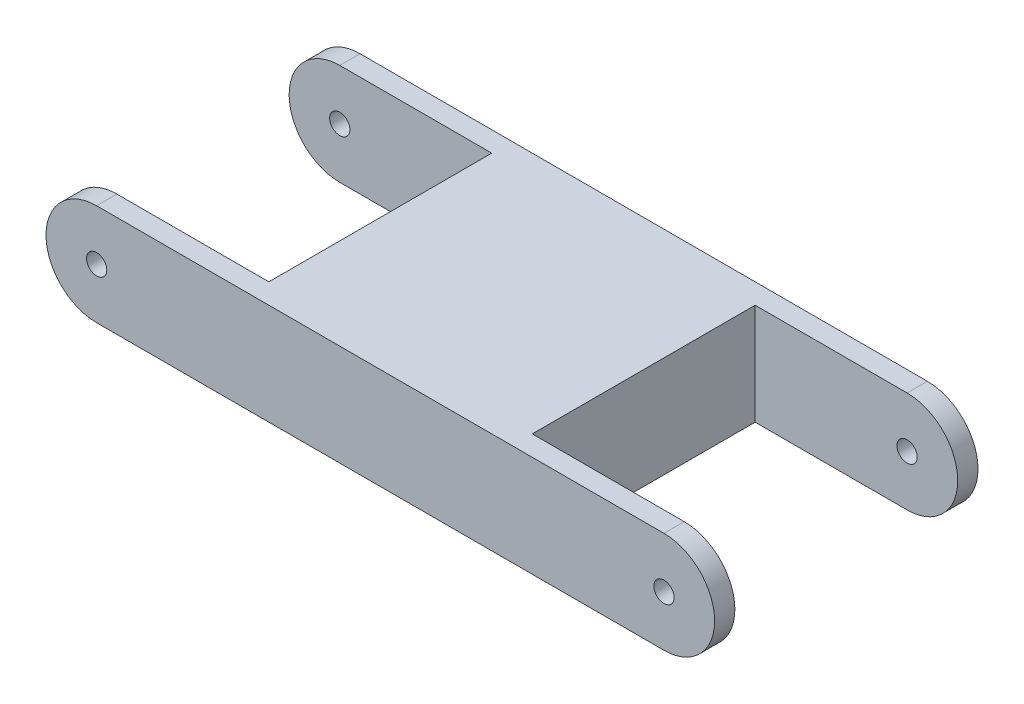
ISO-10303-21;
HEADER;
FILE_DESCRIPTION(('STEP AP214'),'2;1');
FILE_NAME('part.step','',(''),(''),'','','');
FILE_SCHEMA(('AUTOMOTIVE_DESIGN { 1 0 10303 214 1 1 1 1 }'));
ENDSEC;
DATA;
#1=APPLICATION_CONTEXT('core data for automotive mechanical design processes');
#2=APPLICATION_PROTOCOL_DEFINITION('international standard','automotive_design',2000,#1);
#3=PRODUCT_CONTEXT('',#1,'mechanical');
#4=PRODUCT('Part','Part','',(#3));
#5=PRODUCT_RELATED_PRODUCT_CATEGORY('part','',(#4));
#6=PRODUCT_DEFINITION_FORMATION('','',#4);
#7=PRODUCT_DEFINITION_CONTEXT('part definition',#1,'design');
#8=PRODUCT_DEFINITION('design','',#6,#7);
#9=PRODUCT_DEFINITION_SHAPE('','',#8);
#10=(LENGTH_UNIT() NAMED_UNIT(*) SI_UNIT(.MILLI.,.METRE.));
#11=(NAMED_UNIT(*) PLANE_ANGLE_UNIT() SI_UNIT($,.RADIAN.));
#12=(NAMED_UNIT(*) SI_UNIT($,.STERADIAN.) SOLID_ANGLE_UNIT());
#13=UNCERTAINTY_MEASURE_WITH_UNIT(LENGTH_MEASURE(1.E-05),#10,'distance_accuracy_value','');
#14=(GEOMETRIC_REPRESENTATION_CONTEXT(3) GLOBAL_UNCERTAINTY_ASSIGNED_CONTEXT((#13)) GLOBAL_UNIT_ASSIGNED_CONTEXT((#10,
#11,#12)) REPRESENTATION_CONTEXT('',''));
#15=CARTESIAN_POINT('',(0.,0.,0.));
#16=DIRECTION('',(0.,0.,1.));
#17=DIRECTION('',(1.,0.,0.));
#18=AXIS2_PLACEMENT_3D('',#15,#16,#17);
#19=CARTESIAN_POINT('',(-28.,-5.,26.));
#20=DIRECTION('',(0.,1.,0.));
#21=DIRECTION('',(0.,0.,1.));
#22=AXIS2_PLACEMENT_3D('',#19,#20,#21);
#23=PLANE('',#22);
#24=DIRECTION('',(1.,0.,0.));
#25=VECTOR('',#24,1.);
#26=CARTESIAN_POINT('',(-28.,-5.,2.00000000000001));
#27=LINE('',#26,#25);
#28=CARTESIAN_POINT('',(13.,-5.,2.));
#29=VERTEX_POINT('',#28);
#30=CARTESIAN_POINT('',(28.,-5.,1.99999999999999));
#31=VERTEX_POINT('',#30);
#32=EDGE_CURVE('E154',#29,#31,#27,.T.);
#33=ORIENTED_EDGE('',*,*,#32,.F.);
#34=DIRECTION('',(0.,0.,-1.));
#35=VECTOR('',#34,1.);
#36=CARTESIAN_POINT('',(13.,-5.,26.));
#37=LINE('',#36,#35);
#38=CARTESIAN_POINT('',(13.,-5.,24.));
#39=VERTEX_POINT('',#38);
#40=EDGE_CURVE('E156',#39,#29,#37,.T.);
#41=ORIENTED_EDGE('',*,*,#40,.F.);
#42=DIRECTION('',(-1.,0.,0.));
#43=VECTOR('',#42,1.);
#44=CARTESIAN_POINT('',(-28.,-5.,24.));
#45=LINE('',#44,#43);
#46=CARTESIAN_POINT('',(28.,-5.,24.));
#47=VERTEX_POINT('',#46);
#48=EDGE_CURVE('E138',#47,#39,#45,.T.);
#49=ORIENTED_EDGE('',*,*,#48,.F.);
#50=DIRECTION('',(0.,0.,-1.));
#51=VECTOR('',#50,1.);
#52=CARTESIAN_POINT('',(28.,-5.,26.));
#53=LINE('',#52,#51);
#54=CARTESIAN_POINT('',(28.,-5.,26.));
#55=VERTEX_POINT('',#54);
#56=EDGE_CURVE('E214',#55,#47,#53,.T.);
#57=ORIENTED_EDGE('',*,*,#56,.F.);
#58=DIRECTION('',(1.,0.,0.));
#59=VECTOR('',#58,1.);
#60=CARTESIAN_POINT('',(-28.,-5.,26.));
#61=LINE('',#60,#59);
#62=CARTESIAN_POINT('',(-28.,-5.,26.));
#63=VERTEX_POINT('',#62);
#64=EDGE_CURVE('E189',#63,#55,#61,.T.);
#65=ORIENTED_EDGE('',*,*,#64,.F.);
#66=DIRECTION('',(0.,0.,-1.));
#67=VECTOR('',#66,1.);
#68=CARTESIAN_POINT('',(-28.,-5.,26.));
#69=LINE('',#68,#67);
#70=CARTESIAN_POINT('',(-28.,-5.,24.));
#71=VERTEX_POINT('',#70);
#72=EDGE_CURVE('E217',#63,#71,#69,.T.);
#73=ORIENTED_EDGE('',*,*,#72,.T.);
#74=DIRECTION('',(-1.,0.,0.));
#75=VECTOR('',#74,1.);
#76=CARTESIAN_POINT('',(-28.,-5.,24.));
#77=LINE('',#76,#75);
#78=CARTESIAN_POINT('',(-13.,-5.,24.));
#79=VERTEX_POINT('',#78);
#80=EDGE_CURVE('E174',#79,#71,#77,.T.);
#81=ORIENTED_EDGE('',*,*,#80,.F.);
#82=DIRECTION('',(0.,0.,1.));
#83=VECTOR('',#82,1.);
#84=CARTESIAN_POINT('',(-13.,-5.,26.));
#85=LINE('',#84,#83);
#86=CARTESIAN_POINT('',(-13.,-5.,2.));
#87=VERTEX_POINT('',#86);
#88=EDGE_CURVE('E176',#87,#79,#85,.T.);
#89=ORIENTED_EDGE('',*,*,#88,.F.);
#90=DIRECTION('',(1.,0.,0.));
#91=VECTOR('',#90,1.);
#92=CARTESIAN_POINT('',(-28.,-5.,2.));
#93=LINE('',#92,#91);
#94=CARTESIAN_POINT('',(-28.,-5.,2.));
#95=VERTEX_POINT('',#94);
#96=EDGE_CURVE('E167',#95,#87,#93,.T.);
#97=ORIENTED_EDGE('',*,*,#96,.F.);
#98=CARTESIAN_POINT('',(-28.,-5.,0.));
#99=VERTEX_POINT('',#98);
#100=EDGE_CURVE('E216',#95,#99,#69,.T.);
#101=ORIENTED_EDGE('',*,*,#100,.T.);
#102=DIRECTION('',(1.,0.,0.));
#103=VECTOR('',#102,1.);
#104=CARTESIAN_POINT('',(-28.,-5.,0.));
#105=LINE('',#104,#103);
#106=CARTESIAN_POINT('',(28.,-5.,0.));
#107=VERTEX_POINT('',#106);
#108=EDGE_CURVE('E200',#99,#107,#105,.T.);
#109=ORIENTED_EDGE('',*,*,#108,.T.);
#110=EDGE_CURVE('E213',#31,#107,#53,.T.);
#111=ORIENTED_EDGE('',*,*,#110,.F.);
#112=EDGE_LOOP('',(#33,#41,#49,#57,#65,#73,#81,#89,#97,#101,#109,#111));
#113=FACE_BOUND('',#112,.T.);
#114=ADVANCED_FACE('F33',(#113),#23,.F.);
#115=CARTESIAN_POINT('',(-28.,5.,26.));
#116=DIRECTION('',(0.,-1.,0.));
#117=DIRECTION('',(0.,0.,-1.));
#118=AXIS2_PLACEMENT_3D('',#115,#116,#117);
#119=PLANE('',#118);
#120=DIRECTION('',(-1.,0.,0.));
#121=VECTOR('',#120,1.);
#122=CARTESIAN_POINT('',(-28.,5.,2.00000000000001));
#123=LINE('',#122,#121);
#124=CARTESIAN_POINT('',(28.,5.,1.99999999999999));
#125=VERTEX_POINT('',#124);
#126=CARTESIAN_POINT('',(13.,5.,2.));
#127=VERTEX_POINT('',#126);
#128=EDGE_CURVE('E152',#125,#127,#123,.T.);
#129=ORIENTED_EDGE('',*,*,#128,.F.);
#130=DIRECTION('',(0.,0.,-1.));
#131=VECTOR('',#130,1.);
#132=CARTESIAN_POINT('',(28.,5.,26.));
#133=LINE('',#132,#131);
#134=CARTESIAN_POINT('',(28.,5.,0.));
#135=VERTEX_POINT('',#134);
#136=EDGE_CURVE('E211',#125,#135,#133,.T.);
#137=ORIENTED_EDGE('',*,*,#136,.T.);
#138=DIRECTION('',(-1.,0.,0.));
#139=VECTOR('',#138,1.);
#140=CARTESIAN_POINT('',(-28.,5.,0.));
#141=LINE('',#140,#139);
#142=CARTESIAN_POINT('',(-28.,5.,0.));
#143=VERTEX_POINT('',#142);
#144=EDGE_CURVE('E190',#135,#143,#141,.T.);
#145=ORIENTED_EDGE('',*,*,#144,.T.);
#146=DIRECTION('',(0.,0.,-1.));
#147=VECTOR('',#146,1.);
#148=CARTESIAN_POINT('',(-28.,5.,26.));
#149=LINE('',#148,#147);
#150=CARTESIAN_POINT('',(-28.,5.,2.));
#151=VERTEX_POINT('',#150);
#152=EDGE_CURVE('E196',#151,#143,#149,.T.);
#153=ORIENTED_EDGE('',*,*,#152,.F.);
#154=DIRECTION('',(-1.,0.,0.));
#155=VECTOR('',#154,1.);
#156=CARTESIAN_POINT('',(-28.,5.,2.));
#157=LINE('',#156,#155);
#158=CARTESIAN_POINT('',(-13.,5.,2.));
#159=VERTEX_POINT('',#158);
#160=EDGE_CURVE('E163',#159,#151,#157,.T.);
#161=ORIENTED_EDGE('',*,*,#160,.F.);
#162=DIRECTION('',(0.,0.,-1.));
#163=VECTOR('',#162,1.);
#164=CARTESIAN_POINT('',(-13.,5.,26.));
#165=LINE('',#164,#163);
#166=CARTESIAN_POINT('',(-13.,5.,24.));
#167=VERTEX_POINT('',#166);
#168=EDGE_CURVE('E41',#167,#159,#165,.T.);
#169=ORIENTED_EDGE('',*,*,#168,.F.);
#170=DIRECTION('',(1.,0.,0.));
#171=VECTOR('',#170,1.);
#172=CARTESIAN_POINT('',(-28.,5.,24.));
#173=LINE('',#172,#171);
#174=CARTESIAN_POINT('',(-28.,5.,24.));
#175=VERTEX_POINT('',#174);
#176=EDGE_CURVE('E170',#175,#167,#173,.T.);
#177=ORIENTED_EDGE('',*,*,#176,.F.);
#178=CARTESIAN_POINT('',(-28.,5.,26.));
#179=VERTEX_POINT('',#178);
#180=EDGE_CURVE('E208',#179,#175,#149,.T.);
#181=ORIENTED_EDGE('',*,*,#180,.F.);
#182=DIRECTION('',(-1.,0.,0.));
#183=VECTOR('',#182,1.);
#184=CARTESIAN_POINT('',(-28.,5.,26.));
#185=LINE('',#184,#183);
#186=CARTESIAN_POINT('',(28.,5.,26.));
#187=VERTEX_POINT('',#186);
#188=EDGE_CURVE('E194',#187,#179,#185,.T.);
#189=ORIENTED_EDGE('',*,*,#188,.F.);
#190=CARTESIAN_POINT('',(28.,5.,24.));
#191=VERTEX_POINT('',#190);
#192=EDGE_CURVE('E142',#187,#191,#133,.T.);
#193=ORIENTED_EDGE('',*,*,#192,.T.);
#194=DIRECTION('',(1.,0.,0.));
#195=VECTOR('',#194,1.);
#196=CARTESIAN_POINT('',(-28.,5.,24.));
#197=LINE('',#196,#195);
#198=CARTESIAN_POINT('',(13.,5.,24.));
#199=VERTEX_POINT('',#198);
#200=EDGE_CURVE('E135',#199,#191,#197,.T.);
#201=ORIENTED_EDGE('',*,*,#200,.F.);
#202=DIRECTION('',(0.,0.,1.));
#203=VECTOR('',#202,1.);
#204=CARTESIAN_POINT('',(13.,5.,26.));
#205=LINE('',#204,#203);
#206=EDGE_CURVE('E11',#127,#199,#205,.T.);
#207=ORIENTED_EDGE('',*,*,#206,.F.);
#208=EDGE_LOOP('',(#129,#137,#145,#153,#161,#169,#177,#181,#189,#193,#201,#207));
#209=FACE_BOUND('',#208,.T.);
#210=ADVANCED_FACE('F140',(#209),#119,.F.);
#211=CARTESIAN_POINT('',(28.,0.,26.));
#212=DIRECTION('',(0.,0.,-1.));
#213=DIRECTION('',(-1.,0.,0.));
#214=AXIS2_PLACEMENT_3D('',#211,#212,#213);
#215=CYLINDRICAL_SURFACE('',#214,5.);
#216=ORIENTED_EDGE('',*,*,#136,.F.);
#217=CARTESIAN_POINT('',(28.,0.,1.99999999999999));
#218=DIRECTION('',(0.,0.,1.));
#219=DIRECTION('',(1.,0.,0.));
#220=AXIS2_PLACEMENT_3D('',#217,#218,#219);
#221=CIRCLE('',#220,5.);
#222=EDGE_CURVE('E150',#31,#125,#221,.T.);
#223=ORIENTED_EDGE('',*,*,#222,.F.);
#224=ORIENTED_EDGE('',*,*,#110,.T.);
#225=CARTESIAN_POINT('',(28.,0.,0.));
#226=DIRECTION('',(0.,0.,1.));
#227=DIRECTION('',(1.,0.,0.));
#228=AXIS2_PLACEMENT_3D('',#225,#226,#227);
#229=CIRCLE('',#228,5.);
#230=EDGE_CURVE('E203',#107,#135,#229,.T.);
#231=ORIENTED_EDGE('',*,*,#230,.T.);
#232=EDGE_LOOP('',(#216,#223,#224,#231));
#233=FACE_BOUND('',#232,.T.);
#234=ADVANCED_FACE('F245',(#233),#215,.T.);
#235=CARTESIAN_POINT('',(28.,0.,24.));
#236=DIRECTION('',(0.,0.,-1.));
#237=DIRECTION('',(-1.,0.,0.));
#238=AXIS2_PLACEMENT_3D('',#235,#236,#237);
#239=CIRCLE('',#238,5.);
#240=EDGE_CURVE('E48',#191,#47,#239,.T.);
#241=ORIENTED_EDGE('',*,*,#240,.F.);
#242=ORIENTED_EDGE('',*,*,#192,.F.);
#243=CARTESIAN_POINT('',(28.,0.,26.));
#244=DIRECTION('',(0.,0.,1.));
#245=DIRECTION('',(1.,0.,0.));
#246=AXIS2_PLACEMENT_3D('',#243,#244,#245);
#247=CIRCLE('',#246,5.);
#248=EDGE_CURVE('E192',#55,#187,#247,.T.);
#249=ORIENTED_EDGE('',*,*,#248,.F.);
#250=ORIENTED_EDGE('',*,*,#56,.T.);
#251=EDGE_LOOP('',(#241,#242,#249,#250));
#252=FACE_BOUND('',#251,.T.);
#253=ADVANCED_FACE('F282',(#252),#215,.T.);
#254=CARTESIAN_POINT('',(28.,0.,26.));
#255=DIRECTION('',(0.,0.,-1.));
#256=DIRECTION('',(-1.,0.,0.));
#257=AXIS2_PLACEMENT_3D('',#254,#255,#256);
#258=CYLINDRICAL_SURFACE('',#257,0.999999999999998);
#259=CARTESIAN_POINT('',(28.,0.,0.));
#260=DIRECTION('',(0.,0.,1.));
#261=DIRECTION('',(1.,0.,0.));
#262=AXIS2_PLACEMENT_3D('',#259,#260,#261);
#263=CIRCLE('',#262,0.999999999999998);
#264=CARTESIAN_POINT('',(29.,0.,0.));
#265=VERTEX_POINT('',#264);
#266=EDGE_CURVE('E181',#265,#265,#263,.F.);
#267=ORIENTED_EDGE('',*,*,#266,.T.);
#268=EDGE_LOOP('',(#267));
#269=FACE_BOUND('',#268,.T.);
#270=CARTESIAN_POINT('',(28.,0.,1.99999999999999));
#271=DIRECTION('',(0.,0.,1.));
#272=DIRECTION('',(1.,0.,0.));
#273=AXIS2_PLACEMENT_3D('',#270,#271,#272);
#274=CIRCLE('',#273,0.999999999999998);
#275=CARTESIAN_POINT('',(29.,0.,1.99999999999999));
#276=VERTEX_POINT('',#275);
#277=EDGE_CURVE('E144',#276,#276,#274,.T.);
#278=ORIENTED_EDGE('',*,*,#277,.T.);
#279=EDGE_LOOP('',(#278));
#280=FACE_BOUND('',#279,.T.);
#281=ADVANCED_FACE('F233',(#269,#280),#258,.F.);
#282=CARTESIAN_POINT('',(28.,0.,26.));
#283=DIRECTION('',(0.,0.,1.));
#284=DIRECTION('',(-1.,0.,0.));
#285=AXIS2_PLACEMENT_3D('',#282,#283,#284);
#286=CIRCLE('',#285,0.999999999999998);
#287=CARTESIAN_POINT('',(27.,0.,26.));
#288=VERTEX_POINT('',#287);
#289=EDGE_CURVE('E178',#288,#288,#286,.T.);
#290=ORIENTED_EDGE('',*,*,#289,.T.);
#291=EDGE_LOOP('',(#290));
#292=FACE_BOUND('',#291,.T.);
#293=CARTESIAN_POINT('',(28.,0.,24.));
#294=DIRECTION('',(0.,0.,-1.));
#295=DIRECTION('',(-1.,0.,0.));
#296=AXIS2_PLACEMENT_3D('',#293,#294,#295);
#297=CIRCLE('',#296,0.999999999999998);
#298=CARTESIAN_POINT('',(27.,0.,24.));
#299=VERTEX_POINT('',#298);
#300=EDGE_CURVE('E146',#299,#299,#297,.T.);
#301=ORIENTED_EDGE('',*,*,#300,.T.);
#302=EDGE_LOOP('',(#301));
#303=FACE_BOUND('',#302,.T.);
#304=ADVANCED_FACE('F297',(#292,#303),#258,.F.);
#305=CARTESIAN_POINT('',(-28.,0.,26.));
#306=DIRECTION('',(0.,0.,-1.));
#307=DIRECTION('',(-1.,0.,0.));
#308=AXIS2_PLACEMENT_3D('',#305,#306,#307);
#309=CYLINDRICAL_SURFACE('',#308,5.);
#310=ORIENTED_EDGE('',*,*,#180,.T.);
#311=CARTESIAN_POINT('',(-28.,0.,24.));
#312=DIRECTION('',(0.,0.,-1.));
#313=DIRECTION('',(-1.,0.,0.));
#314=AXIS2_PLACEMENT_3D('',#311,#312,#313);
#315=CIRCLE('',#314,5.);
#316=EDGE_CURVE('E172',#71,#175,#315,.T.);
#317=ORIENTED_EDGE('',*,*,#316,.F.);
#318=ORIENTED_EDGE('',*,*,#72,.F.);
#319=CARTESIAN_POINT('',(-28.,0.,26.));
#320=DIRECTION('',(0.,0.,1.));
#321=DIRECTION('',(1.,0.,0.));
#322=AXIS2_PLACEMENT_3D('',#319,#320,#321);
#323=CIRCLE('',#322,5.);
#324=EDGE_CURVE('E186',#179,#63,#323,.T.);
#325=ORIENTED_EDGE('',*,*,#324,.F.);
#326=EDGE_LOOP('',(#310,#317,#318,#325));
#327=FACE_BOUND('',#326,.T.);
#328=ADVANCED_FACE('F35',(#327),#309,.T.);
#329=CARTESIAN_POINT('',(-28.,0.,2.));
#330=DIRECTION('',(0.,0.,1.));
#331=DIRECTION('',(1.,0.,0.));
#332=AXIS2_PLACEMENT_3D('',#329,#330,#331);
#333=CIRCLE('',#332,5.);
#334=EDGE_CURVE('E165',#151,#95,#333,.T.);
#335=ORIENTED_EDGE('',*,*,#334,.F.);
#336=ORIENTED_EDGE('',*,*,#152,.T.);
#337=CARTESIAN_POINT('',(-28.,0.,0.));
#338=DIRECTION('',(0.,0.,1.));
#339=DIRECTION('',(1.,0.,0.));
#340=AXIS2_PLACEMENT_3D('',#337,#338,#339);
#341=CIRCLE('',#340,5.);
#342=EDGE_CURVE('E197',#143,#99,#341,.T.);
#343=ORIENTED_EDGE('',*,*,#342,.T.);
#344=ORIENTED_EDGE('',*,*,#100,.F.);
#345=EDGE_LOOP('',(#335,#336,#343,#344));
#346=FACE_BOUND('',#345,.T.);
#347=ADVANCED_FACE('F259',(#346),#309,.T.);
#348=CARTESIAN_POINT('',(-28.,0.,26.));
#349=DIRECTION('',(0.,0.,-1.));
#350=DIRECTION('',(-1.,0.,0.));
#351=AXIS2_PLACEMENT_3D('',#348,#349,#350);
#352=CYLINDRICAL_SURFACE('',#351,0.999999999999998);
#353=CARTESIAN_POINT('',(-28.,0.,26.));
#354=DIRECTION('',(0.,0.,1.));
#355=DIRECTION('',(1.,0.,0.));
#356=AXIS2_PLACEMENT_3D('',#353,#354,#355);
#357=CIRCLE('',#356,0.999999999999998);
#358=CARTESIAN_POINT('',(-27.,0.,26.));
#359=VERTEX_POINT('',#358);
#360=EDGE_CURVE('E182',#359,#359,#357,.T.);
#361=ORIENTED_EDGE('',*,*,#360,.T.);
#362=EDGE_LOOP('',(#361));
#363=FACE_BOUND('',#362,.T.);
#364=CARTESIAN_POINT('',(-28.,0.,24.));
#365=DIRECTION('',(0.,0.,-1.));
#366=DIRECTION('',(-1.,0.,0.));
#367=AXIS2_PLACEMENT_3D('',#364,#365,#366);
#368=CIRCLE('',#367,0.999999999999998);
#369=CARTESIAN_POINT('',(-29.,0.,24.));
#370=VERTEX_POINT('',#369);
#371=EDGE_CURVE('E169',#370,#370,#368,.T.);
#372=ORIENTED_EDGE('',*,*,#371,.T.);
#373=EDGE_LOOP('',(#372));
#374=FACE_BOUND('',#373,.T.);
#375=ADVANCED_FACE('F292',(#363,#374),#352,.F.);
#376=CARTESIAN_POINT('',(-28.,0.,0.));
#377=DIRECTION('',(0.,0.,1.));
#378=DIRECTION('',(1.,0.,0.));
#379=AXIS2_PLACEMENT_3D('',#376,#377,#378);
#380=CIRCLE('',#379,0.999999999999998);
#381=CARTESIAN_POINT('',(-27.,0.,0.));
#382=VERTEX_POINT('',#381);
#383=EDGE_CURVE('E185',#382,#382,#380,.F.);
#384=ORIENTED_EDGE('',*,*,#383,.T.);
#385=EDGE_LOOP('',(#384));
#386=FACE_BOUND('',#385,.T.);
#387=CARTESIAN_POINT('',(-28.,0.,2.));
#388=DIRECTION('',(0.,0.,1.));
#389=DIRECTION('',(1.,0.,0.));
#390=AXIS2_PLACEMENT_3D('',#387,#388,#389);
#391=CIRCLE('',#390,0.999999999999998);
#392=CARTESIAN_POINT('',(-27.,0.,2.));
#393=VERTEX_POINT('',#392);
#394=EDGE_CURVE('E162',#393,#393,#391,.T.);
#395=ORIENTED_EDGE('',*,*,#394,.T.);
#396=EDGE_LOOP('',(#395));
#397=FACE_BOUND('',#396,.T.);
#398=ADVANCED_FACE('F290',(#386,#397),#352,.F.);
#399=CARTESIAN_POINT('',(-28.,0.,26.));
#400=DIRECTION('',(0.,0.,1.));
#401=DIRECTION('',(1.,0.,0.));
#402=AXIS2_PLACEMENT_3D('',#399,#400,#401);
#403=PLANE('',#402);
#404=ORIENTED_EDGE('',*,*,#360,.F.);
#405=EDGE_LOOP('',(#404));
#406=FACE_BOUND('',#405,.T.);
#407=ORIENTED_EDGE('',*,*,#324,.T.);
#408=ORIENTED_EDGE('',*,*,#64,.T.);
#409=ORIENTED_EDGE('',*,*,#248,.T.);
#410=ORIENTED_EDGE('',*,*,#188,.T.);
#411=EDGE_LOOP('',(#407,#408,#409,#410));
#412=FACE_BOUND('',#411,.T.);
#413=ORIENTED_EDGE('',*,*,#289,.F.);
#414=EDGE_LOOP('',(#413));
#415=FACE_BOUND('',#414,.T.);
#416=ADVANCED_FACE('F286',(#406,#412,#415),#403,.T.);
#417=CARTESIAN_POINT('',(-28.,0.,0.));
#418=DIRECTION('',(0.,0.,1.));
#419=DIRECTION('',(1.,0.,0.));
#420=AXIS2_PLACEMENT_3D('',#417,#418,#419);
#421=PLANE('',#420);
#422=ORIENTED_EDGE('',*,*,#383,.F.);
#423=EDGE_LOOP('',(#422));
#424=FACE_BOUND('',#423,.T.);
#425=ORIENTED_EDGE('',*,*,#342,.F.);
#426=ORIENTED_EDGE('',*,*,#144,.F.);
#427=ORIENTED_EDGE('',*,*,#230,.F.);
#428=ORIENTED_EDGE('',*,*,#108,.F.);
#429=EDGE_LOOP('',(#425,#426,#427,#428));
#430=FACE_BOUND('',#429,.T.);
#431=ORIENTED_EDGE('',*,*,#266,.F.);
#432=EDGE_LOOP('',(#431));
#433=FACE_BOUND('',#432,.T.);
#434=ADVANCED_FACE('F253',(#424,#430,#433),#421,.F.);
#435=CARTESIAN_POINT('',(-13.,30.,2.));
#436=DIRECTION('',(-1.,0.,0.));
#437=DIRECTION('',(0.,0.,1.));
#438=AXIS2_PLACEMENT_3D('',#435,#436,#437);
#439=PLANE('',#438);
#440=ORIENTED_EDGE('',*,*,#88,.T.);
#441=DIRECTION('',(0.,-1.,0.));
#442=VECTOR('',#441,1.);
#443=CARTESIAN_POINT('',(-13.,30.,24.));
#444=LINE('',#443,#442);
#445=EDGE_CURVE('E159',#167,#79,#444,.T.);
#446=ORIENTED_EDGE('',*,*,#445,.F.);
#447=ORIENTED_EDGE('',*,*,#168,.T.);
#448=DIRECTION('',(0.,-1.,0.));
#449=VECTOR('',#448,1.);
#450=CARTESIAN_POINT('',(-13.,30.,2.));
#451=LINE('',#450,#449);
#452=EDGE_CURVE('E56',#159,#87,#451,.T.);
#453=ORIENTED_EDGE('',*,*,#452,.T.);
#454=EDGE_LOOP('',(#440,#446,#447,#453));
#455=FACE_BOUND('',#454,.T.);
#456=ADVANCED_FACE('F270',(#455),#439,.T.);
#457=CARTESIAN_POINT('',(-33.,30.,24.));
#458=DIRECTION('',(0.,0.,-1.));
#459=DIRECTION('',(-1.,0.,0.));
#460=AXIS2_PLACEMENT_3D('',#457,#458,#459);
#461=PLANE('',#460);
#462=ORIENTED_EDGE('',*,*,#371,.F.);
#463=EDGE_LOOP('',(#462));
#464=FACE_BOUND('',#463,.T.);
#465=ORIENTED_EDGE('',*,*,#80,.T.);
#466=ORIENTED_EDGE('',*,*,#316,.T.);
#467=ORIENTED_EDGE('',*,*,#176,.T.);
#468=ORIENTED_EDGE('',*,*,#445,.T.);
#469=EDGE_LOOP('',(#465,#466,#467,#468));
#470=FACE_BOUND('',#469,.T.);
#471=ADVANCED_FACE('F262',(#464,#470),#461,.T.);
#472=CARTESIAN_POINT('',(-33.,30.,2.));
#473=DIRECTION('',(0.,0.,1.));
#474=DIRECTION('',(1.,0.,0.));
#475=AXIS2_PLACEMENT_3D('',#472,#473,#474);
#476=PLANE('',#475);
#477=ORIENTED_EDGE('',*,*,#394,.F.);
#478=EDGE_LOOP('',(#477));
#479=FACE_BOUND('',#478,.T.);
#480=ORIENTED_EDGE('',*,*,#96,.T.);
#481=ORIENTED_EDGE('',*,*,#452,.F.);
#482=ORIENTED_EDGE('',*,*,#160,.T.);
#483=ORIENTED_EDGE('',*,*,#334,.T.);
#484=EDGE_LOOP('',(#480,#481,#482,#483));
#485=FACE_BOUND('',#484,.T.);
#486=ADVANCED_FACE('F260',(#479,#485),#476,.T.);
#487=CARTESIAN_POINT('',(13.,30.,2.));
#488=DIRECTION('',(1.,0.,0.));
#489=DIRECTION('',(0.,0.,-1.));
#490=AXIS2_PLACEMENT_3D('',#487,#488,#489);
#491=PLANE('',#490);
#492=ORIENTED_EDGE('',*,*,#40,.T.);
#493=DIRECTION('',(0.,-1.,0.));
#494=VECTOR('',#493,1.);
#495=CARTESIAN_POINT('',(13.,30.,2.));
#496=LINE('',#495,#494);
#497=EDGE_CURVE('E129',#127,#29,#496,.T.);
#498=ORIENTED_EDGE('',*,*,#497,.F.);
#499=ORIENTED_EDGE('',*,*,#206,.T.);
#500=DIRECTION('',(0.,-1.,0.));
#501=VECTOR('',#500,1.);
#502=CARTESIAN_POINT('',(13.,30.,24.));
#503=LINE('',#502,#501);
#504=EDGE_CURVE('E126',#199,#39,#503,.T.);
#505=ORIENTED_EDGE('',*,*,#504,.T.);
#506=EDGE_LOOP('',(#492,#498,#499,#505));
#507=FACE_BOUND('',#506,.T.);
#508=ADVANCED_FACE('F125',(#507),#491,.T.);
#509=CARTESIAN_POINT('',(33.,30.,1.99999999999999));
#510=DIRECTION('',(0.,0.,1.));
#511=DIRECTION('',(1.,0.,0.));
#512=AXIS2_PLACEMENT_3D('',#509,#510,#511);
#513=PLANE('',#512);
#514=ORIENTED_EDGE('',*,*,#277,.F.);
#515=EDGE_LOOP('',(#514));
#516=FACE_BOUND('',#515,.T.);
#517=ORIENTED_EDGE('',*,*,#32,.T.);
#518=ORIENTED_EDGE('',*,*,#222,.T.);
#519=ORIENTED_EDGE('',*,*,#128,.T.);
#520=ORIENTED_EDGE('',*,*,#497,.T.);
#521=EDGE_LOOP('',(#517,#518,#519,#520));
#522=FACE_BOUND('',#521,.T.);
#523=ADVANCED_FACE('F235',(#516,#522),#513,.T.);
#524=CARTESIAN_POINT('',(33.,30.,24.));
#525=DIRECTION('',(0.,0.,-1.));
#526=DIRECTION('',(-1.,0.,0.));
#527=AXIS2_PLACEMENT_3D('',#524,#525,#526);
#528=PLANE('',#527);
#529=ORIENTED_EDGE('',*,*,#300,.F.);
#530=EDGE_LOOP('',(#529));
#531=FACE_BOUND('',#530,.T.);
#532=ORIENTED_EDGE('',*,*,#48,.T.);
#533=ORIENTED_EDGE('',*,*,#504,.F.);
#534=ORIENTED_EDGE('',*,*,#200,.T.);
#535=ORIENTED_EDGE('',*,*,#240,.T.);
#536=EDGE_LOOP('',(#532,#533,#534,#535));
#537=FACE_BOUND('',#536,.T.);
#538=ADVANCED_FACE('F134',(#531,#537),#528,.T.);
#539=CLOSED_SHELL('',(#114,#210,#234,#253,#281,#304,#328,#347,#375,#398,#416,#434,#456,#471,
#486,#508,#523,#538));
#540=MANIFOLD_SOLID_BREP('B2',#539);
#541=ADVANCED_BREP_SHAPE_REPRESENTATION('',(#18,#540),#14);
#542=SHAPE_DEFINITION_REPRESENTATION(#9,#541);
ENDSEC;
END-ISO-10303-21;
